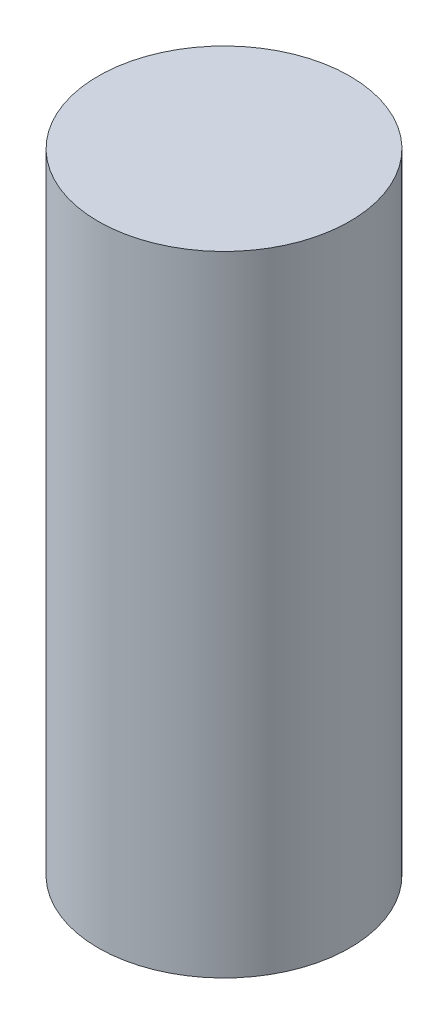
ISO-10303-21;
HEADER;
FILE_DESCRIPTION(('STEP AP214'),'2;1');
FILE_NAME('part.step','',(''),(''),'','','');
FILE_SCHEMA(('AUTOMOTIVE_DESIGN { 1 0 10303 214 1 1 1 1 }'));
ENDSEC;
DATA;
#1=APPLICATION_CONTEXT('core data for automotive mechanical design processes');
#2=APPLICATION_PROTOCOL_DEFINITION('international standard','automotive_design',2000,#1);
#3=PRODUCT_CONTEXT('',#1,'mechanical');
#4=PRODUCT('Part','Part','',(#3));
#5=PRODUCT_RELATED_PRODUCT_CATEGORY('part','',(#4));
#6=PRODUCT_DEFINITION_FORMATION('','',#4);
#7=PRODUCT_DEFINITION_CONTEXT('part definition',#1,'design');
#8=PRODUCT_DEFINITION('design','',#6,#7);
#9=PRODUCT_DEFINITION_SHAPE('','',#8);
#10=(LENGTH_UNIT() NAMED_UNIT(*) SI_UNIT(.MILLI.,.METRE.));
#11=(NAMED_UNIT(*) PLANE_ANGLE_UNIT() SI_UNIT($,.RADIAN.));
#12=(NAMED_UNIT(*) SI_UNIT($,.STERADIAN.) SOLID_ANGLE_UNIT());
#13=UNCERTAINTY_MEASURE_WITH_UNIT(LENGTH_MEASURE(1.E-05),#10,'distance_accuracy_value','');
#14=(GEOMETRIC_REPRESENTATION_CONTEXT(3) GLOBAL_UNCERTAINTY_ASSIGNED_CONTEXT((#13)) GLOBAL_UNIT_ASSIGNED_CONTEXT((#10,
#11,#12)) REPRESENTATION_CONTEXT('',''));
#15=CARTESIAN_POINT('',(0.,0.,0.));
#16=DIRECTION('',(0.,0.,1.));
#17=DIRECTION('',(1.,0.,0.));
#18=AXIS2_PLACEMENT_3D('',#15,#16,#17);
#19=CARTESIAN_POINT('',(0.,7.,0.));
#20=DIRECTION('',(0.,1.,0.));
#21=DIRECTION('',(0.,0.,1.));
#22=AXIS2_PLACEMENT_3D('',#19,#20,#21);
#23=PLANE('',#22);
#24=CARTESIAN_POINT('',(0.,7.,0.));
#25=DIRECTION('',(0.,-1.,0.));
#26=DIRECTION('',(0.,0.,-1.));
#27=AXIS2_PLACEMENT_3D('',#24,#25,#26);
#28=CIRCLE('',#27,1.4);
#29=CARTESIAN_POINT('',(0.,7.,-1.4));
#30=VERTEX_POINT('',#29);
#31=EDGE_CURVE('E10',#30,#30,#28,.T.);
#32=ORIENTED_EDGE('',*,*,#31,.F.);
#33=EDGE_LOOP('',(#32));
#34=FACE_BOUND('',#33,.T.);
#35=ADVANCED_FACE('F43',(#34),#23,.T.);
#36=CARTESIAN_POINT('',(0.,0.,0.));
#37=DIRECTION('',(0.,-1.,0.));
#38=DIRECTION('',(0.,0.,-1.));
#39=AXIS2_PLACEMENT_3D('',#36,#37,#38);
#40=CYLINDRICAL_SURFACE('',#39,1.4);
#41=ORIENTED_EDGE('',*,*,#31,.T.);
#42=EDGE_LOOP('',(#41));
#43=FACE_BOUND('',#42,.T.);
#44=CARTESIAN_POINT('',(0.,0.,0.));
#45=DIRECTION('',(0.,-1.,0.));
#46=DIRECTION('',(0.,0.,-1.));
#47=AXIS2_PLACEMENT_3D('',#44,#45,#46);
#48=CIRCLE('',#47,1.4);
#49=CARTESIAN_POINT('',(0.,0.,-1.4));
#50=VERTEX_POINT('',#49);
#51=EDGE_CURVE('E50',#50,#50,#48,.T.);
#52=ORIENTED_EDGE('',*,*,#51,.F.);
#53=EDGE_LOOP('',(#52));
#54=FACE_BOUND('',#53,.T.);
#55=ADVANCED_FACE('F59',(#43,#54),#40,.T.);
#56=CARTESIAN_POINT('',(0.,0.,0.));
#57=DIRECTION('',(0.,-1.,0.));
#58=DIRECTION('',(0.,0.,-1.));
#59=AXIS2_PLACEMENT_3D('',#56,#57,#58);
#60=PLANE('',#59);
#61=ORIENTED_EDGE('',*,*,#51,.T.);
#62=EDGE_LOOP('',(#61));
#63=FACE_BOUND('',#62,.T.);
#64=ADVANCED_FACE('F57',(#63),#60,.T.);
#65=CLOSED_SHELL('',(#35,#55,#64));
#66=MANIFOLD_SOLID_BREP('B2',#65);
#67=ADVANCED_BREP_SHAPE_REPRESENTATION('',(#18,#66),#14);
#68=SHAPE_DEFINITION_REPRESENTATION(#9,#67);
ENDSEC;
END-ISO-10303-21;
